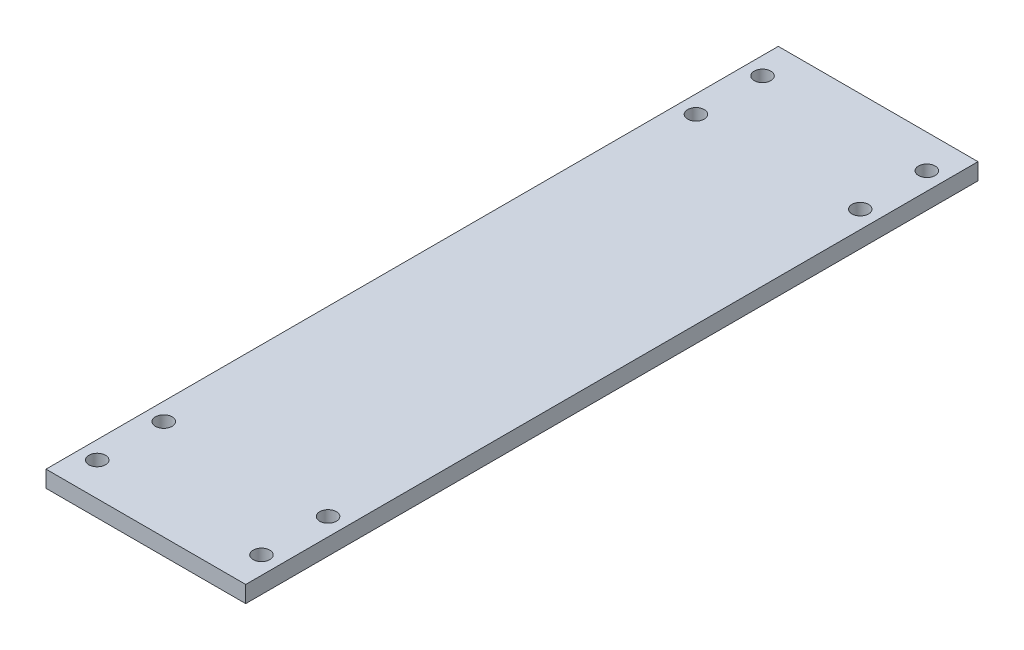
ISO-10303-21;
HEADER;
FILE_DESCRIPTION(('STEP AP214'),'2;1');
FILE_NAME('part.step','',(''),(''),'','','');
FILE_SCHEMA(('AUTOMOTIVE_DESIGN { 1 0 10303 214 1 1 1 1 }'));
ENDSEC;
DATA;
#1=APPLICATION_CONTEXT('core data for automotive mechanical design processes');
#2=APPLICATION_PROTOCOL_DEFINITION('international standard','automotive_design',2000,#1);
#3=PRODUCT_CONTEXT('',#1,'mechanical');
#4=PRODUCT('Part','Part','',(#3));
#5=PRODUCT_RELATED_PRODUCT_CATEGORY('part','',(#4));
#6=PRODUCT_DEFINITION_FORMATION('','',#4);
#7=PRODUCT_DEFINITION_CONTEXT('part definition',#1,'design');
#8=PRODUCT_DEFINITION('design','',#6,#7);
#9=PRODUCT_DEFINITION_SHAPE('','',#8);
#10=(LENGTH_UNIT() NAMED_UNIT(*) SI_UNIT(.MILLI.,.METRE.));
#11=(NAMED_UNIT(*) PLANE_ANGLE_UNIT() SI_UNIT($,.RADIAN.));
#12=(NAMED_UNIT(*) SI_UNIT($,.STERADIAN.) SOLID_ANGLE_UNIT());
#13=UNCERTAINTY_MEASURE_WITH_UNIT(LENGTH_MEASURE(1.E-05),#10,'distance_accuracy_value','');
#14=(GEOMETRIC_REPRESENTATION_CONTEXT(3) GLOBAL_UNCERTAINTY_ASSIGNED_CONTEXT((#13)) GLOBAL_UNIT_ASSIGNED_CONTEXT((#10,
#11,#12)) REPRESENTATION_CONTEXT('',''));
#15=CARTESIAN_POINT('',(0.,0.,0.));
#16=DIRECTION('',(0.,0.,1.));
#17=DIRECTION('',(1.,0.,0.));
#18=AXIS2_PLACEMENT_3D('',#15,#16,#17);
#19=CARTESIAN_POINT('',(-152.4,12.7,0.));
#20=DIRECTION('',(1.,0.,0.));
#21=DIRECTION('',(0.,0.,-1.));
#22=AXIS2_PLACEMENT_3D('',#19,#20,#21);
#23=PLANE('',#22);
#24=DIRECTION('',(0.,0.,1.));
#25=VECTOR('',#24,1.);
#26=CARTESIAN_POINT('',(-152.4,0.,0.));
#27=LINE('',#26,#25);
#28=CARTESIAN_POINT('',(-152.4,0.,0.));
#29=VERTEX_POINT('',#28);
#30=CARTESIAN_POINT('',(-152.4,0.,558.8));
#31=VERTEX_POINT('',#30);
#32=EDGE_CURVE('E95',#29,#31,#27,.T.);
#33=ORIENTED_EDGE('',*,*,#32,.T.);
#34=DIRECTION('',(0.,-1.,0.));
#35=VECTOR('',#34,1.);
#36=CARTESIAN_POINT('',(-152.4,12.7,558.8));
#37=LINE('',#36,#35);
#38=CARTESIAN_POINT('',(-152.4,12.7,558.8));
#39=VERTEX_POINT('',#38);
#40=EDGE_CURVE('E11',#39,#31,#37,.T.);
#41=ORIENTED_EDGE('',*,*,#40,.F.);
#42=DIRECTION('',(0.,0.,1.));
#43=VECTOR('',#42,1.);
#44=CARTESIAN_POINT('',(-152.4,12.7,0.));
#45=LINE('',#44,#43);
#46=CARTESIAN_POINT('',(-152.4,12.7,0.));
#47=VERTEX_POINT('',#46);
#48=EDGE_CURVE('E83',#47,#39,#45,.T.);
#49=ORIENTED_EDGE('',*,*,#48,.F.);
#50=DIRECTION('',(0.,-1.,0.));
#51=VECTOR('',#50,1.);
#52=CARTESIAN_POINT('',(-152.4,12.7,0.));
#53=LINE('',#52,#51);
#54=EDGE_CURVE('E91',#47,#29,#53,.T.);
#55=ORIENTED_EDGE('',*,*,#54,.T.);
#56=EDGE_LOOP('',(#33,#41,#49,#55));
#57=FACE_BOUND('',#56,.T.);
#58=ADVANCED_FACE('F32',(#57),#23,.F.);
#59=CARTESIAN_POINT('',(-152.4,12.7,558.8));
#60=DIRECTION('',(0.,0.,-1.));
#61=DIRECTION('',(-1.,0.,0.));
#62=AXIS2_PLACEMENT_3D('',#59,#60,#61);
#63=PLANE('',#62);
#64=DIRECTION('',(1.,0.,0.));
#65=VECTOR('',#64,1.);
#66=CARTESIAN_POINT('',(-152.4,0.,558.8));
#67=LINE('',#66,#65);
#68=CARTESIAN_POINT('',(0.,0.,558.8));
#69=VERTEX_POINT('',#68);
#70=EDGE_CURVE('E87',#31,#69,#67,.T.);
#71=ORIENTED_EDGE('',*,*,#70,.T.);
#72=DIRECTION('',(0.,-1.,0.));
#73=VECTOR('',#72,1.);
#74=CARTESIAN_POINT('',(0.,12.7,558.8));
#75=LINE('',#74,#73);
#76=CARTESIAN_POINT('',(0.,12.7,558.8));
#77=VERTEX_POINT('',#76);
#78=EDGE_CURVE('E40',#77,#69,#75,.T.);
#79=ORIENTED_EDGE('',*,*,#78,.F.);
#80=DIRECTION('',(1.,0.,0.));
#81=VECTOR('',#80,1.);
#82=CARTESIAN_POINT('',(-152.4,12.7,558.8));
#83=LINE('',#82,#81);
#84=EDGE_CURVE('E78',#39,#77,#83,.T.);
#85=ORIENTED_EDGE('',*,*,#84,.F.);
#86=ORIENTED_EDGE('',*,*,#40,.T.);
#87=EDGE_LOOP('',(#71,#79,#85,#86));
#88=FACE_BOUND('',#87,.T.);
#89=ADVANCED_FACE('F86',(#88),#63,.F.);
#90=CARTESIAN_POINT('',(0.,12.7,0.));
#91=DIRECTION('',(-1.,0.,0.));
#92=DIRECTION('',(0.,0.,1.));
#93=AXIS2_PLACEMENT_3D('',#90,#91,#92);
#94=PLANE('',#93);
#95=DIRECTION('',(0.,0.,-1.));
#96=VECTOR('',#95,1.);
#97=CARTESIAN_POINT('',(0.,0.,0.));
#98=LINE('',#97,#96);
#99=CARTESIAN_POINT('',(0.,0.,0.));
#100=VERTEX_POINT('',#99);
#101=EDGE_CURVE('E65',#69,#100,#98,.T.);
#102=ORIENTED_EDGE('',*,*,#101,.T.);
#103=DIRECTION('',(0.,-1.,0.));
#104=VECTOR('',#103,1.);
#105=CARTESIAN_POINT('',(0.,12.7,0.));
#106=LINE('',#105,#104);
#107=CARTESIAN_POINT('',(0.,12.7,0.));
#108=VERTEX_POINT('',#107);
#109=EDGE_CURVE('E88',#108,#100,#106,.T.);
#110=ORIENTED_EDGE('',*,*,#109,.F.);
#111=DIRECTION('',(0.,0.,-1.));
#112=VECTOR('',#111,1.);
#113=CARTESIAN_POINT('',(0.,12.7,0.));
#114=LINE('',#113,#112);
#115=EDGE_CURVE('E81',#77,#108,#114,.T.);
#116=ORIENTED_EDGE('',*,*,#115,.F.);
#117=ORIENTED_EDGE('',*,*,#78,.T.);
#118=EDGE_LOOP('',(#102,#110,#116,#117));
#119=FACE_BOUND('',#118,.T.);
#120=ADVANCED_FACE('F89',(#119),#94,.F.);
#121=CARTESIAN_POINT('',(-152.4,12.7,0.));
#122=DIRECTION('',(0.,0.,1.));
#123=DIRECTION('',(1.,0.,0.));
#124=AXIS2_PLACEMENT_3D('',#121,#122,#123);
#125=PLANE('',#124);
#126=DIRECTION('',(-1.,0.,0.));
#127=VECTOR('',#126,1.);
#128=CARTESIAN_POINT('',(-152.4,0.,0.));
#129=LINE('',#128,#127);
#130=EDGE_CURVE('E71',#100,#29,#129,.T.);
#131=ORIENTED_EDGE('',*,*,#130,.T.);
#132=ORIENTED_EDGE('',*,*,#54,.F.);
#133=DIRECTION('',(-1.,0.,0.));
#134=VECTOR('',#133,1.);
#135=CARTESIAN_POINT('',(-152.4,12.7,0.));
#136=LINE('',#135,#134);
#137=EDGE_CURVE('E48',#108,#47,#136,.T.);
#138=ORIENTED_EDGE('',*,*,#137,.F.);
#139=ORIENTED_EDGE('',*,*,#109,.T.);
#140=EDGE_LOOP('',(#131,#132,#138,#139));
#141=FACE_BOUND('',#140,.T.);
#142=ADVANCED_FACE('F103',(#141),#125,.F.);
#143=CARTESIAN_POINT('',(0.,12.7,0.));
#144=DIRECTION('',(0.,1.,0.));
#145=DIRECTION('',(0.,0.,1.));
#146=AXIS2_PLACEMENT_3D('',#143,#144,#145);
#147=PLANE('',#146);
#148=CARTESIAN_POINT('',(-138.88567414004,12.7,76.3473532463125));
#149=DIRECTION('',(0.,1.,0.));
#150=DIRECTION('',(0.,0.,1.));
#151=AXIS2_PLACEMENT_3D('',#148,#149,#150);
#152=CIRCLE('',#151,6.34999999999999);
#153=CARTESIAN_POINT('',(-138.88567414004,12.7,82.6973532463125));
#154=VERTEX_POINT('',#153);
#155=EDGE_CURVE('E127',#154,#154,#152,.F.);
#156=ORIENTED_EDGE('',*,*,#155,.T.);
#157=EDGE_LOOP('',(#156));
#158=FACE_BOUND('',#157,.T.);
#159=CARTESIAN_POINT('',(-13.5143258599596,12.7,533.252646753687));
#160=DIRECTION('',(0.,1.,0.));
#161=DIRECTION('',(0.,0.,1.));
#162=AXIS2_PLACEMENT_3D('',#159,#160,#161);
#163=CIRCLE('',#162,6.34999999999999);
#164=CARTESIAN_POINT('',(-13.5143258599596,12.7,539.602646753687));
#165=VERTEX_POINT('',#164);
#166=EDGE_CURVE('E134',#165,#165,#163,.F.);
#167=ORIENTED_EDGE('',*,*,#166,.T.);
#168=EDGE_LOOP('',(#167));
#169=FACE_BOUND('',#168,.T.);
#170=CARTESIAN_POINT('',(-13.5143258599596,12.7,482.452646753687));
#171=DIRECTION('',(0.,1.,0.));
#172=DIRECTION('',(0.,0.,1.));
#173=AXIS2_PLACEMENT_3D('',#170,#171,#172);
#174=CIRCLE('',#173,6.34999999999999);
#175=CARTESIAN_POINT('',(-13.5143258599596,12.7,488.802646753687));
#176=VERTEX_POINT('',#175);
#177=EDGE_CURVE('E115',#176,#176,#174,.F.);
#178=ORIENTED_EDGE('',*,*,#177,.T.);
#179=EDGE_LOOP('',(#178));
#180=FACE_BOUND('',#179,.T.);
#181=CARTESIAN_POINT('',(-13.5143258599596,12.7,76.3473532463125));
#182=DIRECTION('',(0.,1.,0.));
#183=DIRECTION('',(0.,0.,1.));
#184=AXIS2_PLACEMENT_3D('',#181,#182,#183);
#185=CIRCLE('',#184,6.35);
#186=CARTESIAN_POINT('',(-13.5143258599596,12.7,82.6973532463125));
#187=VERTEX_POINT('',#186);
#188=EDGE_CURVE('E122',#187,#187,#185,.F.);
#189=ORIENTED_EDGE('',*,*,#188,.T.);
#190=EDGE_LOOP('',(#189));
#191=FACE_BOUND('',#190,.T.);
#192=CARTESIAN_POINT('',(-138.88567414004,12.7,25.5473532463125));
#193=DIRECTION('',(0.,1.,0.));
#194=DIRECTION('',(0.,0.,1.));
#195=AXIS2_PLACEMENT_3D('',#192,#193,#194);
#196=CIRCLE('',#195,6.35);
#197=CARTESIAN_POINT('',(-138.88567414004,12.7,31.8973532463125));
#198=VERTEX_POINT('',#197);
#199=EDGE_CURVE('E151',#198,#198,#196,.F.);
#200=ORIENTED_EDGE('',*,*,#199,.T.);
#201=EDGE_LOOP('',(#200));
#202=FACE_BOUND('',#201,.T.);
#203=CARTESIAN_POINT('',(-138.88567414004,12.7,482.452646753687));
#204=DIRECTION('',(0.,1.,0.));
#205=DIRECTION('',(0.,0.,1.));
#206=AXIS2_PLACEMENT_3D('',#203,#204,#205);
#207=CIRCLE('',#206,6.35000000000002);
#208=CARTESIAN_POINT('',(-138.88567414004,12.7,488.802646753687));
#209=VERTEX_POINT('',#208);
#210=EDGE_CURVE('E145',#209,#209,#207,.F.);
#211=ORIENTED_EDGE('',*,*,#210,.T.);
#212=EDGE_LOOP('',(#211));
#213=FACE_BOUND('',#212,.T.);
#214=CARTESIAN_POINT('',(-138.88567414004,12.7,533.252646753687));
#215=DIRECTION('',(0.,1.,0.));
#216=DIRECTION('',(0.,0.,1.));
#217=AXIS2_PLACEMENT_3D('',#214,#215,#216);
#218=CIRCLE('',#217,6.35000000000002);
#219=CARTESIAN_POINT('',(-138.88567414004,12.7,539.602646753687));
#220=VERTEX_POINT('',#219);
#221=EDGE_CURVE('E139',#220,#220,#218,.F.);
#222=ORIENTED_EDGE('',*,*,#221,.T.);
#223=EDGE_LOOP('',(#222));
#224=FACE_BOUND('',#223,.T.);
#225=CARTESIAN_POINT('',(-13.5143258599596,12.7,25.5473532463125));
#226=DIRECTION('',(0.,1.,0.));
#227=DIRECTION('',(0.,0.,1.));
#228=AXIS2_PLACEMENT_3D('',#225,#226,#227);
#229=CIRCLE('',#228,6.35);
#230=CARTESIAN_POINT('',(-13.5143258599596,12.7,31.8973532463125));
#231=VERTEX_POINT('',#230);
#232=EDGE_CURVE('E109',#231,#231,#229,.F.);
#233=ORIENTED_EDGE('',*,*,#232,.T.);
#234=EDGE_LOOP('',(#233));
#235=FACE_BOUND('',#234,.T.);
#236=ORIENTED_EDGE('',*,*,#48,.T.);
#237=ORIENTED_EDGE('',*,*,#84,.T.);
#238=ORIENTED_EDGE('',*,*,#115,.T.);
#239=ORIENTED_EDGE('',*,*,#137,.T.);
#240=EDGE_LOOP('',(#236,#237,#238,#239));
#241=FACE_BOUND('',#240,.T.);
#242=ADVANCED_FACE('F79',(#158,#169,#180,#191,#202,#213,#224,#235,#241),#147,.T.);
#243=CARTESIAN_POINT('',(0.,0.,0.));
#244=DIRECTION('',(0.,1.,0.));
#245=DIRECTION('',(0.,0.,1.));
#246=AXIS2_PLACEMENT_3D('',#243,#244,#245);
#247=PLANE('',#246);
#248=CARTESIAN_POINT('',(-138.88567414004,0.,76.3473532463125));
#249=DIRECTION('',(0.,-1.,0.));
#250=DIRECTION('',(0.,0.,1.));
#251=AXIS2_PLACEMENT_3D('',#248,#249,#250);
#252=CIRCLE('',#251,6.34999999999999);
#253=CARTESIAN_POINT('',(-138.88567414004,0.,82.6973532463125));
#254=VERTEX_POINT('',#253);
#255=EDGE_CURVE('E130',#254,#254,#252,.T.);
#256=ORIENTED_EDGE('',*,*,#255,.F.);
#257=EDGE_LOOP('',(#256));
#258=FACE_BOUND('',#257,.T.);
#259=CARTESIAN_POINT('',(-13.5143258599596,0.,533.252646753687));
#260=DIRECTION('',(0.,-1.,0.));
#261=DIRECTION('',(0.,0.,1.));
#262=AXIS2_PLACEMENT_3D('',#259,#260,#261);
#263=CIRCLE('',#262,6.34999999999999);
#264=CARTESIAN_POINT('',(-13.5143258599596,0.,539.602646753687));
#265=VERTEX_POINT('',#264);
#266=EDGE_CURVE('E119',#265,#265,#263,.T.);
#267=ORIENTED_EDGE('',*,*,#266,.F.);
#268=EDGE_LOOP('',(#267));
#269=FACE_BOUND('',#268,.T.);
#270=CARTESIAN_POINT('',(-13.5143258599596,0.,482.452646753687));
#271=DIRECTION('',(0.,-1.,0.));
#272=DIRECTION('',(0.,0.,1.));
#273=AXIS2_PLACEMENT_3D('',#270,#271,#272);
#274=CIRCLE('',#273,6.34999999999999);
#275=CARTESIAN_POINT('',(-13.5143258599596,0.,488.802646753687));
#276=VERTEX_POINT('',#275);
#277=EDGE_CURVE('E118',#276,#276,#274,.T.);
#278=ORIENTED_EDGE('',*,*,#277,.F.);
#279=EDGE_LOOP('',(#278));
#280=FACE_BOUND('',#279,.T.);
#281=CARTESIAN_POINT('',(-13.5143258599596,0.,76.3473532463125));
#282=DIRECTION('',(0.,-1.,0.));
#283=DIRECTION('',(0.,0.,-1.));
#284=AXIS2_PLACEMENT_3D('',#281,#282,#283);
#285=CIRCLE('',#284,6.35);
#286=CARTESIAN_POINT('',(-13.5143258599596,0.,69.9973532463125));
#287=VERTEX_POINT('',#286);
#288=EDGE_CURVE('E112',#287,#287,#285,.T.);
#289=ORIENTED_EDGE('',*,*,#288,.F.);
#290=EDGE_LOOP('',(#289));
#291=FACE_BOUND('',#290,.T.);
#292=CARTESIAN_POINT('',(-138.88567414004,0.,25.5473532463125));
#293=DIRECTION('',(0.,-1.,0.));
#294=DIRECTION('',(0.,0.,1.));
#295=AXIS2_PLACEMENT_3D('',#292,#293,#294);
#296=CIRCLE('',#295,6.35);
#297=CARTESIAN_POINT('',(-138.88567414004,0.,31.8973532463125));
#298=VERTEX_POINT('',#297);
#299=EDGE_CURVE('E131',#298,#298,#296,.T.);
#300=ORIENTED_EDGE('',*,*,#299,.F.);
#301=EDGE_LOOP('',(#300));
#302=FACE_BOUND('',#301,.T.);
#303=CARTESIAN_POINT('',(-138.88567414004,0.,482.452646753687));
#304=DIRECTION('',(0.,-1.,0.));
#305=DIRECTION('',(0.,0.,-1.));
#306=AXIS2_PLACEMENT_3D('',#303,#304,#305);
#307=CIRCLE('',#306,6.35000000000002);
#308=CARTESIAN_POINT('',(-138.88567414004,0.,476.102646753687));
#309=VERTEX_POINT('',#308);
#310=EDGE_CURVE('E148',#309,#309,#307,.T.);
#311=ORIENTED_EDGE('',*,*,#310,.F.);
#312=EDGE_LOOP('',(#311));
#313=FACE_BOUND('',#312,.T.);
#314=CARTESIAN_POINT('',(-138.88567414004,0.,533.252646753687));
#315=DIRECTION('',(0.,-1.,0.));
#316=DIRECTION('',(0.,0.,-1.));
#317=AXIS2_PLACEMENT_3D('',#314,#315,#316);
#318=CIRCLE('',#317,6.35000000000002);
#319=CARTESIAN_POINT('',(-138.88567414004,0.,526.902646753687));
#320=VERTEX_POINT('',#319);
#321=EDGE_CURVE('E142',#320,#320,#318,.T.);
#322=ORIENTED_EDGE('',*,*,#321,.F.);
#323=EDGE_LOOP('',(#322));
#324=FACE_BOUND('',#323,.T.);
#325=CARTESIAN_POINT('',(-13.5143258599596,0.,25.5473532463125));
#326=DIRECTION('',(0.,-1.,0.));
#327=DIRECTION('',(0.,0.,-1.));
#328=AXIS2_PLACEMENT_3D('',#325,#326,#327);
#329=CIRCLE('',#328,6.35);
#330=CARTESIAN_POINT('',(-13.5143258599596,0.,19.1973532463125));
#331=VERTEX_POINT('',#330);
#332=EDGE_CURVE('E98',#331,#331,#329,.T.);
#333=ORIENTED_EDGE('',*,*,#332,.F.);
#334=EDGE_LOOP('',(#333));
#335=FACE_BOUND('',#334,.T.);
#336=ORIENTED_EDGE('',*,*,#32,.F.);
#337=ORIENTED_EDGE('',*,*,#130,.F.);
#338=ORIENTED_EDGE('',*,*,#101,.F.);
#339=ORIENTED_EDGE('',*,*,#70,.F.);
#340=EDGE_LOOP('',(#336,#337,#338,#339));
#341=FACE_BOUND('',#340,.T.);
#342=ADVANCED_FACE('F106',(#258,#269,#280,#291,#302,#313,#324,#335,#341),#247,.F.);
#343=CARTESIAN_POINT('',(-13.5143258599596,12.701,25.5473532463125));
#344=DIRECTION('',(0.,-1.,0.));
#345=DIRECTION('',(0.,0.,-1.));
#346=AXIS2_PLACEMENT_3D('',#343,#344,#345);
#347=CYLINDRICAL_SURFACE('',#346,6.35);
#348=ORIENTED_EDGE('',*,*,#232,.F.);
#349=EDGE_LOOP('',(#348));
#350=FACE_BOUND('',#349,.T.);
#351=ORIENTED_EDGE('',*,*,#332,.T.);
#352=EDGE_LOOP('',(#351));
#353=FACE_BOUND('',#352,.T.);
#354=ADVANCED_FACE('F161',(#350,#353),#347,.F.);
#355=CARTESIAN_POINT('',(-138.88567414004,12.701,533.252646753687));
#356=DIRECTION('',(0.,-1.,0.));
#357=DIRECTION('',(0.,0.,-1.));
#358=AXIS2_PLACEMENT_3D('',#355,#356,#357);
#359=CYLINDRICAL_SURFACE('',#358,6.35000000000002);
#360=ORIENTED_EDGE('',*,*,#221,.F.);
#361=EDGE_LOOP('',(#360));
#362=FACE_BOUND('',#361,.T.);
#363=ORIENTED_EDGE('',*,*,#321,.T.);
#364=EDGE_LOOP('',(#363));
#365=FACE_BOUND('',#364,.T.);
#366=ADVANCED_FACE('F171',(#362,#365),#359,.F.);
#367=CARTESIAN_POINT('',(-138.88567414004,12.701,482.452646753687));
#368=DIRECTION('',(0.,-1.,0.));
#369=DIRECTION('',(0.,0.,-1.));
#370=AXIS2_PLACEMENT_3D('',#367,#368,#369);
#371=CYLINDRICAL_SURFACE('',#370,6.35000000000002);
#372=ORIENTED_EDGE('',*,*,#210,.F.);
#373=EDGE_LOOP('',(#372));
#374=FACE_BOUND('',#373,.T.);
#375=ORIENTED_EDGE('',*,*,#310,.T.);
#376=EDGE_LOOP('',(#375));
#377=FACE_BOUND('',#376,.T.);
#378=ADVANCED_FACE('F177',(#374,#377),#371,.F.);
#379=CARTESIAN_POINT('',(-138.88567414004,12.701,25.5473532463125));
#380=DIRECTION('',(0.,-1.,0.));
#381=DIRECTION('',(0.,0.,-1.));
#382=AXIS2_PLACEMENT_3D('',#379,#380,#381);
#383=CYLINDRICAL_SURFACE('',#382,6.35);
#384=ORIENTED_EDGE('',*,*,#199,.F.);
#385=EDGE_LOOP('',(#384));
#386=FACE_BOUND('',#385,.T.);
#387=ORIENTED_EDGE('',*,*,#299,.T.);
#388=EDGE_LOOP('',(#387));
#389=FACE_BOUND('',#388,.T.);
#390=ADVANCED_FACE('F157',(#386,#389),#383,.F.);
#391=CARTESIAN_POINT('',(-13.5143258599596,12.701,76.3473532463125));
#392=DIRECTION('',(0.,-1.,0.));
#393=DIRECTION('',(0.,0.,-1.));
#394=AXIS2_PLACEMENT_3D('',#391,#392,#393);
#395=CYLINDRICAL_SURFACE('',#394,6.35);
#396=ORIENTED_EDGE('',*,*,#188,.F.);
#397=EDGE_LOOP('',(#396));
#398=FACE_BOUND('',#397,.T.);
#399=ORIENTED_EDGE('',*,*,#288,.T.);
#400=EDGE_LOOP('',(#399));
#401=FACE_BOUND('',#400,.T.);
#402=ADVANCED_FACE('F219',(#398,#401),#395,.F.);
#403=CARTESIAN_POINT('',(-13.5143258599596,12.701,482.452646753687));
#404=DIRECTION('',(0.,-1.,0.));
#405=DIRECTION('',(0.,0.,-1.));
#406=AXIS2_PLACEMENT_3D('',#403,#404,#405);
#407=CYLINDRICAL_SURFACE('',#406,6.34999999999999);
#408=ORIENTED_EDGE('',*,*,#177,.F.);
#409=EDGE_LOOP('',(#408));
#410=FACE_BOUND('',#409,.T.);
#411=ORIENTED_EDGE('',*,*,#277,.T.);
#412=EDGE_LOOP('',(#411));
#413=FACE_BOUND('',#412,.T.);
#414=ADVANCED_FACE('F227',(#410,#413),#407,.F.);
#415=CARTESIAN_POINT('',(-13.5143258599596,12.701,533.252646753687));
#416=DIRECTION('',(0.,-1.,0.));
#417=DIRECTION('',(0.,0.,-1.));
#418=AXIS2_PLACEMENT_3D('',#415,#416,#417);
#419=CYLINDRICAL_SURFACE('',#418,6.34999999999999);
#420=ORIENTED_EDGE('',*,*,#166,.F.);
#421=EDGE_LOOP('',(#420));
#422=FACE_BOUND('',#421,.T.);
#423=ORIENTED_EDGE('',*,*,#266,.T.);
#424=EDGE_LOOP('',(#423));
#425=FACE_BOUND('',#424,.T.);
#426=ADVANCED_FACE('F223',(#422,#425),#419,.F.);
#427=CARTESIAN_POINT('',(-138.88567414004,12.701,76.3473532463125));
#428=DIRECTION('',(0.,-1.,0.));
#429=DIRECTION('',(0.,0.,-1.));
#430=AXIS2_PLACEMENT_3D('',#427,#428,#429);
#431=CYLINDRICAL_SURFACE('',#430,6.34999999999999);
#432=ORIENTED_EDGE('',*,*,#155,.F.);
#433=EDGE_LOOP('',(#432));
#434=FACE_BOUND('',#433,.T.);
#435=ORIENTED_EDGE('',*,*,#255,.T.);
#436=EDGE_LOOP('',(#435));
#437=FACE_BOUND('',#436,.T.);
#438=ADVANCED_FACE('F226',(#434,#437),#431,.F.);
#439=CLOSED_SHELL('',(#58,#89,#120,#142,#242,#342,#354,#366,#378,#390,#402,#414,#426,#438));
#440=MANIFOLD_SOLID_BREP('B2',#439);
#441=ADVANCED_BREP_SHAPE_REPRESENTATION('',(#18,#440),#14);
#442=SHAPE_DEFINITION_REPRESENTATION(#9,#441);
ENDSEC;
END-ISO-10303-21;
